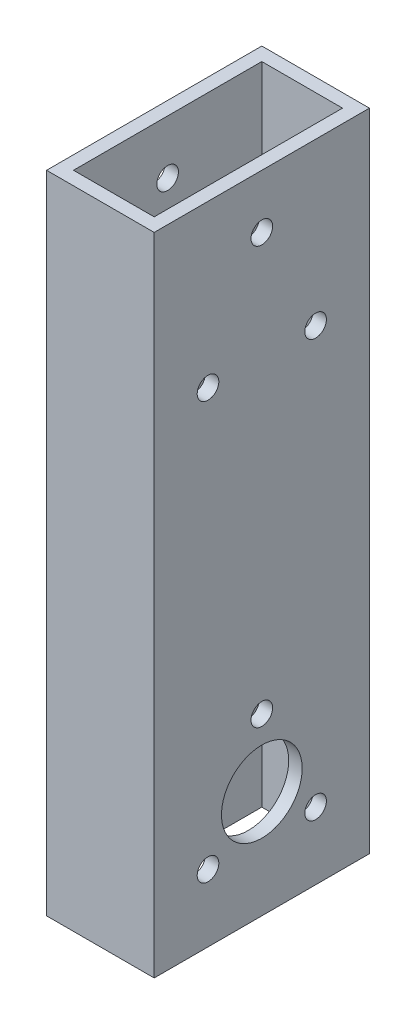
ISO-10303-21;
HEADER;
FILE_DESCRIPTION(('STEP AP214'),'2;1');
FILE_NAME('part.step','',(''),(''),'','','');
FILE_SCHEMA(('AUTOMOTIVE_DESIGN { 1 0 10303 214 1 1 1 1 }'));
ENDSEC;
DATA;
#1=APPLICATION_CONTEXT('core data for automotive mechanical design processes');
#2=APPLICATION_PROTOCOL_DEFINITION('international standard','automotive_design',2000,#1);
#3=PRODUCT_CONTEXT('',#1,'mechanical');
#4=PRODUCT('Part','Part','',(#3));
#5=PRODUCT_RELATED_PRODUCT_CATEGORY('part','',(#4));
#6=PRODUCT_DEFINITION_FORMATION('','',#4);
#7=PRODUCT_DEFINITION_CONTEXT('part definition',#1,'design');
#8=PRODUCT_DEFINITION('design','',#6,#7);
#9=PRODUCT_DEFINITION_SHAPE('','',#8);
#10=(LENGTH_UNIT() NAMED_UNIT(*) SI_UNIT(.MILLI.,.METRE.));
#11=(NAMED_UNIT(*) PLANE_ANGLE_UNIT() SI_UNIT($,.RADIAN.));
#12=(NAMED_UNIT(*) SI_UNIT($,.STERADIAN.) SOLID_ANGLE_UNIT());
#13=UNCERTAINTY_MEASURE_WITH_UNIT(LENGTH_MEASURE(1.E-05),#10,'distance_accuracy_value','');
#14=(GEOMETRIC_REPRESENTATION_CONTEXT(3) GLOBAL_UNCERTAINTY_ASSIGNED_CONTEXT((#13)) GLOBAL_UNIT_ASSIGNED_CONTEXT((#10,
#11,#12)) REPRESENTATION_CONTEXT('',''));
#15=CARTESIAN_POINT('',(0.,0.,0.));
#16=DIRECTION('',(0.,0.,1.));
#17=DIRECTION('',(1.,0.,0.));
#18=AXIS2_PLACEMENT_3D('',#15,#16,#17);
#19=CARTESIAN_POINT('',(0.,152.4,0.));
#20=DIRECTION('',(0.,-1.,0.));
#21=DIRECTION('',(0.,0.,-1.));
#22=AXIS2_PLACEMENT_3D('',#19,#20,#21);
#23=PLANE('',#22);
#24=DIRECTION('',(0.,0.,1.));
#25=VECTOR('',#24,1.);
#26=CARTESIAN_POINT('',(0.,152.4,0.));
#27=LINE('',#26,#25);
#28=CARTESIAN_POINT('',(0.,152.4,-50.8));
#29=VERTEX_POINT('',#28);
#30=CARTESIAN_POINT('',(0.,152.4,0.));
#31=VERTEX_POINT('',#30);
#32=EDGE_CURVE('E138',#29,#31,#27,.T.);
#33=ORIENTED_EDGE('',*,*,#32,.T.);
#34=DIRECTION('',(1.,0.,0.));
#35=VECTOR('',#34,1.);
#36=CARTESIAN_POINT('',(0.,152.4,0.));
#37=LINE('',#36,#35);
#38=CARTESIAN_POINT('',(25.4,152.4,0.));
#39=VERTEX_POINT('',#38);
#40=EDGE_CURVE('E141',#31,#39,#37,.T.);
#41=ORIENTED_EDGE('',*,*,#40,.T.);
#42=DIRECTION('',(0.,0.,-1.));
#43=VECTOR('',#42,1.);
#44=CARTESIAN_POINT('',(25.4,152.4,0.));
#45=LINE('',#44,#43);
#46=CARTESIAN_POINT('',(25.4,152.4,-50.8));
#47=VERTEX_POINT('',#46);
#48=EDGE_CURVE('E144',#39,#47,#45,.T.);
#49=ORIENTED_EDGE('',*,*,#48,.T.);
#50=DIRECTION('',(-1.,0.,0.));
#51=VECTOR('',#50,1.);
#52=CARTESIAN_POINT('',(0.,152.4,-50.8));
#53=LINE('',#52,#51);
#54=EDGE_CURVE('E146',#47,#29,#53,.T.);
#55=ORIENTED_EDGE('',*,*,#54,.T.);
#56=EDGE_LOOP('',(#33,#41,#49,#55));
#57=FACE_BOUND('',#56,.T.);
#58=DIRECTION('',(0.,0.,1.));
#59=VECTOR('',#58,1.);
#60=CARTESIAN_POINT('',(3.175,152.4,-3.175));
#61=LINE('',#60,#59);
#62=CARTESIAN_POINT('',(3.175,152.4,-47.625));
#63=VERTEX_POINT('',#62);
#64=CARTESIAN_POINT('',(3.175,152.4,-3.175));
#65=VERTEX_POINT('',#64);
#66=EDGE_CURVE('E100',#63,#65,#61,.T.);
#67=ORIENTED_EDGE('',*,*,#66,.F.);
#68=DIRECTION('',(-1.,0.,0.));
#69=VECTOR('',#68,1.);
#70=CARTESIAN_POINT('',(3.175,152.4,-47.625));
#71=LINE('',#70,#69);
#72=CARTESIAN_POINT('',(22.225,152.4,-47.625));
#73=VERTEX_POINT('',#72);
#74=EDGE_CURVE('E122',#73,#63,#71,.T.);
#75=ORIENTED_EDGE('',*,*,#74,.F.);
#76=DIRECTION('',(0.,0.,-1.));
#77=VECTOR('',#76,1.);
#78=CARTESIAN_POINT('',(22.225,152.4,-3.175));
#79=LINE('',#78,#77);
#80=CARTESIAN_POINT('',(22.225,152.4,-3.175));
#81=VERTEX_POINT('',#80);
#82=EDGE_CURVE('E120',#81,#73,#79,.T.);
#83=ORIENTED_EDGE('',*,*,#82,.F.);
#84=DIRECTION('',(1.,0.,0.));
#85=VECTOR('',#84,1.);
#86=CARTESIAN_POINT('',(3.175,152.4,-3.175));
#87=LINE('',#86,#85);
#88=EDGE_CURVE('E108',#65,#81,#87,.T.);
#89=ORIENTED_EDGE('',*,*,#88,.F.);
#90=EDGE_LOOP('',(#67,#75,#83,#89));
#91=FACE_BOUND('',#90,.T.);
#92=ADVANCED_FACE('F33',(#57,#91),#23,.F.);
#93=CARTESIAN_POINT('',(0.,0.,0.));
#94=DIRECTION('',(0.,-1.,0.));
#95=DIRECTION('',(0.,0.,-1.));
#96=AXIS2_PLACEMENT_3D('',#93,#94,#95);
#97=PLANE('',#96);
#98=DIRECTION('',(0.,0.,1.));
#99=VECTOR('',#98,1.);
#100=CARTESIAN_POINT('',(0.,0.,0.));
#101=LINE('',#100,#99);
#102=CARTESIAN_POINT('',(0.,0.,-50.8));
#103=VERTEX_POINT('',#102);
#104=CARTESIAN_POINT('',(0.,0.,0.));
#105=VERTEX_POINT('',#104);
#106=EDGE_CURVE('E116',#103,#105,#101,.T.);
#107=ORIENTED_EDGE('',*,*,#106,.F.);
#108=DIRECTION('',(-1.,0.,0.));
#109=VECTOR('',#108,1.);
#110=CARTESIAN_POINT('',(0.,0.,-50.8));
#111=LINE('',#110,#109);
#112=CARTESIAN_POINT('',(25.4,0.,-50.8));
#113=VERTEX_POINT('',#112);
#114=EDGE_CURVE('E142',#113,#103,#111,.T.);
#115=ORIENTED_EDGE('',*,*,#114,.F.);
#116=DIRECTION('',(0.,0.,-1.));
#117=VECTOR('',#116,1.);
#118=CARTESIAN_POINT('',(25.4,0.,0.));
#119=LINE('',#118,#117);
#120=CARTESIAN_POINT('',(25.4,0.,0.));
#121=VERTEX_POINT('',#120);
#122=EDGE_CURVE('E153',#121,#113,#119,.T.);
#123=ORIENTED_EDGE('',*,*,#122,.F.);
#124=DIRECTION('',(1.,0.,0.));
#125=VECTOR('',#124,1.);
#126=CARTESIAN_POINT('',(0.,0.,0.));
#127=LINE('',#126,#125);
#128=EDGE_CURVE('E151',#105,#121,#127,.T.);
#129=ORIENTED_EDGE('',*,*,#128,.F.);
#130=EDGE_LOOP('',(#107,#115,#123,#129));
#131=FACE_BOUND('',#130,.T.);
#132=DIRECTION('',(-1.,0.,0.));
#133=VECTOR('',#132,1.);
#134=CARTESIAN_POINT('',(3.175,0.,-47.625));
#135=LINE('',#134,#133);
#136=CARTESIAN_POINT('',(22.225,0.,-47.625));
#137=VERTEX_POINT('',#136);
#138=CARTESIAN_POINT('',(3.175,0.,-47.625));
#139=VERTEX_POINT('',#138);
#140=EDGE_CURVE('E109',#137,#139,#135,.T.);
#141=ORIENTED_EDGE('',*,*,#140,.T.);
#142=DIRECTION('',(0.,0.,1.));
#143=VECTOR('',#142,1.);
#144=CARTESIAN_POINT('',(3.175,0.,-3.175));
#145=LINE('',#144,#143);
#146=CARTESIAN_POINT('',(3.175,0.,-3.175));
#147=VERTEX_POINT('',#146);
#148=EDGE_CURVE('E58',#139,#147,#145,.T.);
#149=ORIENTED_EDGE('',*,*,#148,.T.);
#150=DIRECTION('',(1.,0.,0.));
#151=VECTOR('',#150,1.);
#152=CARTESIAN_POINT('',(3.175,0.,-3.175));
#153=LINE('',#152,#151);
#154=CARTESIAN_POINT('',(22.225,0.,-3.175));
#155=VERTEX_POINT('',#154);
#156=EDGE_CURVE('E115',#147,#155,#153,.T.);
#157=ORIENTED_EDGE('',*,*,#156,.T.);
#158=DIRECTION('',(0.,0.,-1.));
#159=VECTOR('',#158,1.);
#160=CARTESIAN_POINT('',(22.225,0.,-3.175));
#161=LINE('',#160,#159);
#162=EDGE_CURVE('E130',#155,#137,#161,.T.);
#163=ORIENTED_EDGE('',*,*,#162,.T.);
#164=EDGE_LOOP('',(#141,#149,#157,#163));
#165=FACE_BOUND('',#164,.T.);
#166=ADVANCED_FACE('F260',(#131,#165),#97,.T.);
#167=CARTESIAN_POINT('',(0.,152.4,0.));
#168=DIRECTION('',(1.,0.,0.));
#169=DIRECTION('',(0.,0.,-1.));
#170=AXIS2_PLACEMENT_3D('',#167,#168,#169);
#171=PLANE('',#170);
#172=CARTESIAN_POINT('',(0.,25.4,-25.4));
#173=DIRECTION('',(1.,0.,0.));
#174=DIRECTION('',(0.,0.,-1.));
#175=AXIS2_PLACEMENT_3D('',#172,#173,#174);
#176=CIRCLE('',#175,9.525);
#177=CARTESIAN_POINT('',(0.,25.4,-34.925));
#178=VERTEX_POINT('',#177);
#179=EDGE_CURVE('E371',#178,#178,#176,.T.);
#180=ORIENTED_EDGE('',*,*,#179,.T.);
#181=EDGE_LOOP('',(#180));
#182=FACE_BOUND('',#181,.T.);
#183=CARTESIAN_POINT('',(0.,15.8749999999994,-38.1));
#184=DIRECTION('',(1.,0.,0.));
#185=DIRECTION('',(0.,0.,-1.));
#186=AXIS2_PLACEMENT_3D('',#183,#184,#185);
#187=CIRCLE('',#186,2.55269999999998);
#188=CARTESIAN_POINT('',(0.,15.8749999999994,-40.6527));
#189=VERTEX_POINT('',#188);
#190=EDGE_CURVE('E194',#189,#189,#187,.T.);
#191=ORIENTED_EDGE('',*,*,#190,.T.);
#192=EDGE_LOOP('',(#191));
#193=FACE_BOUND('',#192,.T.);
#194=CARTESIAN_POINT('',(0.,15.8749999999994,-12.7));
#195=DIRECTION('',(1.,0.,0.));
#196=DIRECTION('',(0.,0.,-1.));
#197=AXIS2_PLACEMENT_3D('',#194,#195,#196);
#198=CIRCLE('',#197,2.55270000000011);
#199=CARTESIAN_POINT('',(0.,15.8749999999994,-15.2527000000001));
#200=VERTEX_POINT('',#199);
#201=EDGE_CURVE('E211',#200,#200,#198,.T.);
#202=ORIENTED_EDGE('',*,*,#201,.T.);
#203=EDGE_LOOP('',(#202));
#204=FACE_BOUND('',#203,.T.);
#205=CARTESIAN_POINT('',(0.,41.275,-25.4));
#206=DIRECTION('',(1.,0.,0.));
#207=DIRECTION('',(0.,0.,-1.));
#208=AXIS2_PLACEMENT_3D('',#205,#206,#207);
#209=CIRCLE('',#208,2.55269999999999);
#210=CARTESIAN_POINT('',(0.,41.275,-27.9527));
#211=VERTEX_POINT('',#210);
#212=EDGE_CURVE('E218',#211,#211,#209,.T.);
#213=ORIENTED_EDGE('',*,*,#212,.T.);
#214=EDGE_LOOP('',(#213));
#215=FACE_BOUND('',#214,.T.);
#216=CARTESIAN_POINT('',(0.,114.3,-38.1));
#217=DIRECTION('',(1.,0.,0.));
#218=DIRECTION('',(0.,0.,-1.));
#219=AXIS2_PLACEMENT_3D('',#216,#217,#218);
#220=CIRCLE('',#219,2.5527);
#221=CARTESIAN_POINT('',(0.,114.3,-40.6527));
#222=VERTEX_POINT('',#221);
#223=EDGE_CURVE('E225',#222,#222,#220,.T.);
#224=ORIENTED_EDGE('',*,*,#223,.T.);
#225=EDGE_LOOP('',(#224));
#226=FACE_BOUND('',#225,.T.);
#227=CARTESIAN_POINT('',(0.,114.3,-12.7));
#228=DIRECTION('',(1.,0.,0.));
#229=DIRECTION('',(0.,0.,-1.));
#230=AXIS2_PLACEMENT_3D('',#227,#228,#229);
#231=CIRCLE('',#230,2.5527);
#232=CARTESIAN_POINT('',(0.,114.3,-15.2527));
#233=VERTEX_POINT('',#232);
#234=EDGE_CURVE('E232',#233,#233,#231,.T.);
#235=ORIENTED_EDGE('',*,*,#234,.T.);
#236=EDGE_LOOP('',(#235));
#237=FACE_BOUND('',#236,.T.);
#238=CARTESIAN_POINT('',(0.,139.7,-25.4));
#239=DIRECTION('',(1.,0.,0.));
#240=DIRECTION('',(0.,0.,-1.));
#241=AXIS2_PLACEMENT_3D('',#238,#239,#240);
#242=CIRCLE('',#241,2.5527);
#243=CARTESIAN_POINT('',(0.,139.7,-27.9527));
#244=VERTEX_POINT('',#243);
#245=EDGE_CURVE('E128',#244,#244,#242,.T.);
#246=ORIENTED_EDGE('',*,*,#245,.T.);
#247=EDGE_LOOP('',(#246));
#248=FACE_BOUND('',#247,.T.);
#249=ORIENTED_EDGE('',*,*,#106,.T.);
#250=DIRECTION('',(0.,-1.,0.));
#251=VECTOR('',#250,1.);
#252=CARTESIAN_POINT('',(0.,152.4,0.));
#253=LINE('',#252,#251);
#254=EDGE_CURVE('E11',#31,#105,#253,.T.);
#255=ORIENTED_EDGE('',*,*,#254,.F.);
#256=ORIENTED_EDGE('',*,*,#32,.F.);
#257=DIRECTION('',(0.,-1.,0.));
#258=VECTOR('',#257,1.);
#259=CARTESIAN_POINT('',(0.,152.4,-50.8));
#260=LINE('',#259,#258);
#261=EDGE_CURVE('E148',#29,#103,#260,.T.);
#262=ORIENTED_EDGE('',*,*,#261,.T.);
#263=EDGE_LOOP('',(#249,#255,#256,#262));
#264=FACE_BOUND('',#263,.T.);
#265=ADVANCED_FACE('F35',(#182,#193,#204,#215,#226,#237,#248,#264),#171,.F.);
#266=CARTESIAN_POINT('',(0.,152.4,0.));
#267=DIRECTION('',(0.,0.,-1.));
#268=DIRECTION('',(-1.,0.,0.));
#269=AXIS2_PLACEMENT_3D('',#266,#267,#268);
#270=PLANE('',#269);
#271=ORIENTED_EDGE('',*,*,#128,.T.);
#272=DIRECTION('',(0.,-1.,0.));
#273=VECTOR('',#272,1.);
#274=CARTESIAN_POINT('',(25.4,152.4,0.));
#275=LINE('',#274,#273);
#276=EDGE_CURVE('E42',#39,#121,#275,.T.);
#277=ORIENTED_EDGE('',*,*,#276,.F.);
#278=ORIENTED_EDGE('',*,*,#40,.F.);
#279=ORIENTED_EDGE('',*,*,#254,.T.);
#280=EDGE_LOOP('',(#271,#277,#278,#279));
#281=FACE_BOUND('',#280,.T.);
#282=ADVANCED_FACE('F277',(#281),#270,.F.);
#283=CARTESIAN_POINT('',(25.4,152.4,0.));
#284=DIRECTION('',(-1.,0.,0.));
#285=DIRECTION('',(0.,0.,1.));
#286=AXIS2_PLACEMENT_3D('',#283,#284,#285);
#287=PLANE('',#286);
#288=CARTESIAN_POINT('',(25.4,25.4,-25.4));
#289=DIRECTION('',(1.,0.,0.));
#290=DIRECTION('',(0.,0.,-1.));
#291=AXIS2_PLACEMENT_3D('',#288,#289,#290);
#292=CIRCLE('',#291,9.525);
#293=CARTESIAN_POINT('',(25.4,25.4,-34.925));
#294=VERTEX_POINT('',#293);
#295=EDGE_CURVE('E370',#294,#294,#292,.T.);
#296=ORIENTED_EDGE('',*,*,#295,.F.);
#297=EDGE_LOOP('',(#296));
#298=FACE_BOUND('',#297,.T.);
#299=CARTESIAN_POINT('',(25.4,15.8749999999994,-38.1));
#300=DIRECTION('',(1.,0.,0.));
#301=DIRECTION('',(0.,0.,-1.));
#302=AXIS2_PLACEMENT_3D('',#299,#300,#301);
#303=CIRCLE('',#302,2.55269999999998);
#304=CARTESIAN_POINT('',(25.4,15.8749999999994,-40.6527));
#305=VERTEX_POINT('',#304);
#306=EDGE_CURVE('E190',#305,#305,#303,.T.);
#307=ORIENTED_EDGE('',*,*,#306,.F.);
#308=EDGE_LOOP('',(#307));
#309=FACE_BOUND('',#308,.T.);
#310=CARTESIAN_POINT('',(25.4,15.8749999999994,-12.7));
#311=DIRECTION('',(1.,0.,0.));
#312=DIRECTION('',(0.,0.,-1.));
#313=AXIS2_PLACEMENT_3D('',#310,#311,#312);
#314=CIRCLE('',#313,2.55270000000011);
#315=CARTESIAN_POINT('',(25.4,15.8749999999994,-15.2527000000001));
#316=VERTEX_POINT('',#315);
#317=EDGE_CURVE('E186',#316,#316,#314,.T.);
#318=ORIENTED_EDGE('',*,*,#317,.F.);
#319=EDGE_LOOP('',(#318));
#320=FACE_BOUND('',#319,.T.);
#321=CARTESIAN_POINT('',(25.4,41.275,-25.4));
#322=DIRECTION('',(1.,0.,0.));
#323=DIRECTION('',(0.,0.,-1.));
#324=AXIS2_PLACEMENT_3D('',#321,#322,#323);
#325=CIRCLE('',#324,2.55269999999999);
#326=CARTESIAN_POINT('',(25.4,41.275,-27.9527));
#327=VERTEX_POINT('',#326);
#328=EDGE_CURVE('E182',#327,#327,#325,.T.);
#329=ORIENTED_EDGE('',*,*,#328,.F.);
#330=EDGE_LOOP('',(#329));
#331=FACE_BOUND('',#330,.T.);
#332=CARTESIAN_POINT('',(25.4,114.3,-38.1));
#333=DIRECTION('',(1.,0.,0.));
#334=DIRECTION('',(0.,0.,-1.));
#335=AXIS2_PLACEMENT_3D('',#332,#333,#334);
#336=CIRCLE('',#335,2.5527);
#337=CARTESIAN_POINT('',(25.4,114.3,-40.6527));
#338=VERTEX_POINT('',#337);
#339=EDGE_CURVE('E177',#338,#338,#336,.T.);
#340=ORIENTED_EDGE('',*,*,#339,.F.);
#341=EDGE_LOOP('',(#340));
#342=FACE_BOUND('',#341,.T.);
#343=CARTESIAN_POINT('',(25.4,114.3,-12.7));
#344=DIRECTION('',(1.,0.,0.));
#345=DIRECTION('',(0.,0.,-1.));
#346=AXIS2_PLACEMENT_3D('',#343,#344,#345);
#347=CIRCLE('',#346,2.5527);
#348=CARTESIAN_POINT('',(25.4,114.3,-15.2527));
#349=VERTEX_POINT('',#348);
#350=EDGE_CURVE('E172',#349,#349,#347,.T.);
#351=ORIENTED_EDGE('',*,*,#350,.F.);
#352=EDGE_LOOP('',(#351));
#353=FACE_BOUND('',#352,.T.);
#354=CARTESIAN_POINT('',(25.4,139.7,-25.4));
#355=DIRECTION('',(1.,0.,0.));
#356=DIRECTION('',(0.,0.,-1.));
#357=AXIS2_PLACEMENT_3D('',#354,#355,#356);
#358=CIRCLE('',#357,2.5527);
#359=CARTESIAN_POINT('',(25.4,139.7,-27.9527));
#360=VERTEX_POINT('',#359);
#361=EDGE_CURVE('E167',#360,#360,#358,.T.);
#362=ORIENTED_EDGE('',*,*,#361,.F.);
#363=EDGE_LOOP('',(#362));
#364=FACE_BOUND('',#363,.T.);
#365=ORIENTED_EDGE('',*,*,#122,.T.);
#366=DIRECTION('',(0.,-1.,0.));
#367=VECTOR('',#366,1.);
#368=CARTESIAN_POINT('',(25.4,152.4,-50.8));
#369=LINE('',#368,#367);
#370=EDGE_CURVE('E158',#47,#113,#369,.T.);
#371=ORIENTED_EDGE('',*,*,#370,.F.);
#372=ORIENTED_EDGE('',*,*,#48,.F.);
#373=ORIENTED_EDGE('',*,*,#276,.T.);
#374=EDGE_LOOP('',(#365,#371,#372,#373));
#375=FACE_BOUND('',#374,.T.);
#376=ADVANCED_FACE('F274',(#298,#309,#320,#331,#342,#353,#364,#375),#287,.F.);
#377=CARTESIAN_POINT('',(0.,152.4,-50.8));
#378=DIRECTION('',(0.,0.,1.));
#379=DIRECTION('',(1.,0.,0.));
#380=AXIS2_PLACEMENT_3D('',#377,#378,#379);
#381=PLANE('',#380);
#382=ORIENTED_EDGE('',*,*,#114,.T.);
#383=ORIENTED_EDGE('',*,*,#261,.F.);
#384=ORIENTED_EDGE('',*,*,#54,.F.);
#385=ORIENTED_EDGE('',*,*,#370,.T.);
#386=EDGE_LOOP('',(#382,#383,#384,#385));
#387=FACE_BOUND('',#386,.T.);
#388=ADVANCED_FACE('F271',(#387),#381,.F.);
#389=CARTESIAN_POINT('',(3.175,152.4,-3.175));
#390=DIRECTION('',(1.,0.,0.));
#391=DIRECTION('',(0.,0.,-1.));
#392=AXIS2_PLACEMENT_3D('',#389,#390,#391);
#393=PLANE('',#392);
#394=CARTESIAN_POINT('',(3.175,25.4,-25.4));
#395=DIRECTION('',(1.,0.,0.));
#396=DIRECTION('',(0.,0.,-1.));
#397=AXIS2_PLACEMENT_3D('',#394,#395,#396);
#398=CIRCLE('',#397,9.525);
#399=CARTESIAN_POINT('',(3.175,25.4,-34.925));
#400=VERTEX_POINT('',#399);
#401=EDGE_CURVE('E197',#400,#400,#398,.T.);
#402=ORIENTED_EDGE('',*,*,#401,.F.);
#403=EDGE_LOOP('',(#402));
#404=FACE_BOUND('',#403,.T.);
#405=CARTESIAN_POINT('',(3.175,15.8749999999994,-38.1));
#406=DIRECTION('',(1.,0.,0.));
#407=DIRECTION('',(0.,0.,-1.));
#408=AXIS2_PLACEMENT_3D('',#405,#406,#407);
#409=CIRCLE('',#408,2.55269999999998);
#410=CARTESIAN_POINT('',(3.175,15.8749999999994,-40.6527));
#411=VERTEX_POINT('',#410);
#412=EDGE_CURVE('E189',#411,#411,#409,.T.);
#413=ORIENTED_EDGE('',*,*,#412,.F.);
#414=EDGE_LOOP('',(#413));
#415=FACE_BOUND('',#414,.T.);
#416=CARTESIAN_POINT('',(3.175,15.8749999999994,-12.7));
#417=DIRECTION('',(1.,0.,0.));
#418=DIRECTION('',(0.,0.,-1.));
#419=AXIS2_PLACEMENT_3D('',#416,#417,#418);
#420=CIRCLE('',#419,2.55270000000011);
#421=CARTESIAN_POINT('',(3.175,15.8749999999994,-15.2527000000001));
#422=VERTEX_POINT('',#421);
#423=EDGE_CURVE('E185',#422,#422,#420,.T.);
#424=ORIENTED_EDGE('',*,*,#423,.F.);
#425=EDGE_LOOP('',(#424));
#426=FACE_BOUND('',#425,.T.);
#427=CARTESIAN_POINT('',(3.175,41.275,-25.4));
#428=DIRECTION('',(1.,0.,0.));
#429=DIRECTION('',(0.,0.,-1.));
#430=AXIS2_PLACEMENT_3D('',#427,#428,#429);
#431=CIRCLE('',#430,2.55269999999999);
#432=CARTESIAN_POINT('',(3.175,41.275,-27.9527));
#433=VERTEX_POINT('',#432);
#434=EDGE_CURVE('E181',#433,#433,#431,.T.);
#435=ORIENTED_EDGE('',*,*,#434,.F.);
#436=EDGE_LOOP('',(#435));
#437=FACE_BOUND('',#436,.T.);
#438=CARTESIAN_POINT('',(3.175,114.3,-38.1));
#439=DIRECTION('',(1.,0.,0.));
#440=DIRECTION('',(0.,0.,-1.));
#441=AXIS2_PLACEMENT_3D('',#438,#439,#440);
#442=CIRCLE('',#441,2.5527);
#443=CARTESIAN_POINT('',(3.175,114.3,-40.6527));
#444=VERTEX_POINT('',#443);
#445=EDGE_CURVE('E176',#444,#444,#442,.T.);
#446=ORIENTED_EDGE('',*,*,#445,.F.);
#447=EDGE_LOOP('',(#446));
#448=FACE_BOUND('',#447,.T.);
#449=CARTESIAN_POINT('',(3.175,114.3,-12.7));
#450=DIRECTION('',(1.,0.,0.));
#451=DIRECTION('',(0.,0.,-1.));
#452=AXIS2_PLACEMENT_3D('',#449,#450,#451);
#453=CIRCLE('',#452,2.5527);
#454=CARTESIAN_POINT('',(3.175,114.3,-15.2527));
#455=VERTEX_POINT('',#454);
#456=EDGE_CURVE('E171',#455,#455,#453,.T.);
#457=ORIENTED_EDGE('',*,*,#456,.F.);
#458=EDGE_LOOP('',(#457));
#459=FACE_BOUND('',#458,.T.);
#460=CARTESIAN_POINT('',(3.175,139.7,-25.4));
#461=DIRECTION('',(1.,0.,0.));
#462=DIRECTION('',(0.,0.,-1.));
#463=AXIS2_PLACEMENT_3D('',#460,#461,#462);
#464=CIRCLE('',#463,2.5527);
#465=CARTESIAN_POINT('',(3.175,139.7,-27.9527));
#466=VERTEX_POINT('',#465);
#467=EDGE_CURVE('E166',#466,#466,#464,.T.);
#468=ORIENTED_EDGE('',*,*,#467,.F.);
#469=EDGE_LOOP('',(#468));
#470=FACE_BOUND('',#469,.T.);
#471=ORIENTED_EDGE('',*,*,#148,.F.);
#472=DIRECTION('',(0.,-1.,0.));
#473=VECTOR('',#472,1.);
#474=CARTESIAN_POINT('',(3.175,152.4,-47.625));
#475=LINE('',#474,#473);
#476=EDGE_CURVE('E104',#63,#139,#475,.T.);
#477=ORIENTED_EDGE('',*,*,#476,.F.);
#478=ORIENTED_EDGE('',*,*,#66,.T.);
#479=DIRECTION('',(0.,-1.,0.));
#480=VECTOR('',#479,1.);
#481=CARTESIAN_POINT('',(3.175,152.4,-3.175));
#482=LINE('',#481,#480);
#483=EDGE_CURVE('E103',#65,#147,#482,.T.);
#484=ORIENTED_EDGE('',*,*,#483,.T.);
#485=EDGE_LOOP('',(#471,#477,#478,#484));
#486=FACE_BOUND('',#485,.T.);
#487=ADVANCED_FACE('F102',(#404,#415,#426,#437,#448,#459,#470,#486),#393,.T.);
#488=CARTESIAN_POINT('',(3.175,152.4,-3.175));
#489=DIRECTION('',(0.,0.,-1.));
#490=DIRECTION('',(-1.,0.,0.));
#491=AXIS2_PLACEMENT_3D('',#488,#489,#490);
#492=PLANE('',#491);
#493=ORIENTED_EDGE('',*,*,#156,.F.);
#494=ORIENTED_EDGE('',*,*,#483,.F.);
#495=ORIENTED_EDGE('',*,*,#88,.T.);
#496=DIRECTION('',(0.,-1.,0.));
#497=VECTOR('',#496,1.);
#498=CARTESIAN_POINT('',(22.225,152.4,-3.175));
#499=LINE('',#498,#497);
#500=EDGE_CURVE('E117',#81,#155,#499,.T.);
#501=ORIENTED_EDGE('',*,*,#500,.T.);
#502=EDGE_LOOP('',(#493,#494,#495,#501));
#503=FACE_BOUND('',#502,.T.);
#504=ADVANCED_FACE('F112',(#503),#492,.T.);
#505=CARTESIAN_POINT('',(22.225,152.4,-3.175));
#506=DIRECTION('',(-1.,0.,0.));
#507=DIRECTION('',(0.,0.,1.));
#508=AXIS2_PLACEMENT_3D('',#505,#506,#507);
#509=PLANE('',#508);
#510=CARTESIAN_POINT('',(22.225,25.4,-25.4));
#511=DIRECTION('',(-1.,0.,0.));
#512=DIRECTION('',(0.,0.,1.));
#513=AXIS2_PLACEMENT_3D('',#510,#511,#512);
#514=CIRCLE('',#513,9.525);
#515=CARTESIAN_POINT('',(22.225,25.4,-15.875));
#516=VERTEX_POINT('',#515);
#517=EDGE_CURVE('E37',#516,#516,#514,.T.);
#518=ORIENTED_EDGE('',*,*,#517,.F.);
#519=EDGE_LOOP('',(#518));
#520=FACE_BOUND('',#519,.T.);
#521=CARTESIAN_POINT('',(22.225,15.8749999999994,-38.1));
#522=DIRECTION('',(-1.,0.,0.));
#523=DIRECTION('',(0.,0.,1.));
#524=AXIS2_PLACEMENT_3D('',#521,#522,#523);
#525=CIRCLE('',#524,2.55269999999998);
#526=CARTESIAN_POINT('',(22.225,15.8749999999994,-35.5473));
#527=VERTEX_POINT('',#526);
#528=EDGE_CURVE('E187',#527,#527,#525,.T.);
#529=ORIENTED_EDGE('',*,*,#528,.F.);
#530=EDGE_LOOP('',(#529));
#531=FACE_BOUND('',#530,.T.);
#532=CARTESIAN_POINT('',(22.225,15.8749999999994,-12.7));
#533=DIRECTION('',(-1.,0.,0.));
#534=DIRECTION('',(0.,0.,1.));
#535=AXIS2_PLACEMENT_3D('',#532,#533,#534);
#536=CIRCLE('',#535,2.55270000000011);
#537=CARTESIAN_POINT('',(22.225,15.8749999999994,-10.1472999999999));
#538=VERTEX_POINT('',#537);
#539=EDGE_CURVE('E183',#538,#538,#536,.T.);
#540=ORIENTED_EDGE('',*,*,#539,.F.);
#541=EDGE_LOOP('',(#540));
#542=FACE_BOUND('',#541,.T.);
#543=CARTESIAN_POINT('',(22.225,41.275,-25.4));
#544=DIRECTION('',(-1.,0.,0.));
#545=DIRECTION('',(0.,0.,1.));
#546=AXIS2_PLACEMENT_3D('',#543,#544,#545);
#547=CIRCLE('',#546,2.55269999999999);
#548=CARTESIAN_POINT('',(22.225,41.275,-22.8473));
#549=VERTEX_POINT('',#548);
#550=EDGE_CURVE('E178',#549,#549,#547,.T.);
#551=ORIENTED_EDGE('',*,*,#550,.F.);
#552=EDGE_LOOP('',(#551));
#553=FACE_BOUND('',#552,.T.);
#554=CARTESIAN_POINT('',(22.225,114.3,-38.1));
#555=DIRECTION('',(-1.,0.,0.));
#556=DIRECTION('',(0.,0.,1.));
#557=AXIS2_PLACEMENT_3D('',#554,#555,#556);
#558=CIRCLE('',#557,2.5527);
#559=CARTESIAN_POINT('',(22.225,114.3,-35.5473));
#560=VERTEX_POINT('',#559);
#561=EDGE_CURVE('E173',#560,#560,#558,.T.);
#562=ORIENTED_EDGE('',*,*,#561,.F.);
#563=EDGE_LOOP('',(#562));
#564=FACE_BOUND('',#563,.T.);
#565=CARTESIAN_POINT('',(22.225,114.3,-12.7));
#566=DIRECTION('',(-1.,0.,0.));
#567=DIRECTION('',(0.,0.,1.));
#568=AXIS2_PLACEMENT_3D('',#565,#566,#567);
#569=CIRCLE('',#568,2.5527);
#570=CARTESIAN_POINT('',(22.225,114.3,-10.1473));
#571=VERTEX_POINT('',#570);
#572=EDGE_CURVE('E168',#571,#571,#569,.T.);
#573=ORIENTED_EDGE('',*,*,#572,.F.);
#574=EDGE_LOOP('',(#573));
#575=FACE_BOUND('',#574,.T.);
#576=CARTESIAN_POINT('',(22.225,139.7,-25.4));
#577=DIRECTION('',(-1.,0.,0.));
#578=DIRECTION('',(0.,0.,1.));
#579=AXIS2_PLACEMENT_3D('',#576,#577,#578);
#580=CIRCLE('',#579,2.5527);
#581=CARTESIAN_POINT('',(22.225,139.7,-22.8473));
#582=VERTEX_POINT('',#581);
#583=EDGE_CURVE('E163',#582,#582,#580,.T.);
#584=ORIENTED_EDGE('',*,*,#583,.F.);
#585=EDGE_LOOP('',(#584));
#586=FACE_BOUND('',#585,.T.);
#587=ORIENTED_EDGE('',*,*,#162,.F.);
#588=ORIENTED_EDGE('',*,*,#500,.F.);
#589=ORIENTED_EDGE('',*,*,#82,.T.);
#590=DIRECTION('',(0.,-1.,0.));
#591=VECTOR('',#590,1.);
#592=CARTESIAN_POINT('',(22.225,152.4,-47.625));
#593=LINE('',#592,#591);
#594=EDGE_CURVE('E50',#73,#137,#593,.T.);
#595=ORIENTED_EDGE('',*,*,#594,.T.);
#596=EDGE_LOOP('',(#587,#588,#589,#595));
#597=FACE_BOUND('',#596,.T.);
#598=ADVANCED_FACE('F301',(#520,#531,#542,#553,#564,#575,#586,#597),#509,.T.);
#599=CARTESIAN_POINT('',(3.175,152.4,-47.625));
#600=DIRECTION('',(0.,0.,1.));
#601=DIRECTION('',(1.,0.,0.));
#602=AXIS2_PLACEMENT_3D('',#599,#600,#601);
#603=PLANE('',#602);
#604=ORIENTED_EDGE('',*,*,#140,.F.);
#605=ORIENTED_EDGE('',*,*,#594,.F.);
#606=ORIENTED_EDGE('',*,*,#74,.T.);
#607=ORIENTED_EDGE('',*,*,#476,.T.);
#608=EDGE_LOOP('',(#604,#605,#606,#607));
#609=FACE_BOUND('',#608,.T.);
#610=ADVANCED_FACE('F256',(#609),#603,.T.);
#611=CARTESIAN_POINT('',(-25.4,139.7,-25.4));
#612=DIRECTION('',(1.,0.,0.));
#613=DIRECTION('',(0.,0.,-1.));
#614=AXIS2_PLACEMENT_3D('',#611,#612,#613);
#615=CYLINDRICAL_SURFACE('',#614,2.5527);
#616=ORIENTED_EDGE('',*,*,#583,.T.);
#617=EDGE_LOOP('',(#616));
#618=FACE_BOUND('',#617,.T.);
#619=ORIENTED_EDGE('',*,*,#361,.T.);
#620=EDGE_LOOP('',(#619));
#621=FACE_BOUND('',#620,.T.);
#622=ADVANCED_FACE('F246',(#618,#621),#615,.F.);
#623=ORIENTED_EDGE('',*,*,#467,.T.);
#624=EDGE_LOOP('',(#623));
#625=FACE_BOUND('',#624,.T.);
#626=ORIENTED_EDGE('',*,*,#245,.F.);
#627=EDGE_LOOP('',(#626));
#628=FACE_BOUND('',#627,.T.);
#629=ADVANCED_FACE('F243',(#625,#628),#615,.F.);
#630=CARTESIAN_POINT('',(-25.4,114.3,-12.7));
#631=DIRECTION('',(1.,0.,0.));
#632=DIRECTION('',(0.,0.,-1.));
#633=AXIS2_PLACEMENT_3D('',#630,#631,#632);
#634=CYLINDRICAL_SURFACE('',#633,2.5527);
#635=ORIENTED_EDGE('',*,*,#572,.T.);
#636=EDGE_LOOP('',(#635));
#637=FACE_BOUND('',#636,.T.);
#638=ORIENTED_EDGE('',*,*,#350,.T.);
#639=EDGE_LOOP('',(#638));
#640=FACE_BOUND('',#639,.T.);
#641=ADVANCED_FACE('F245',(#637,#640),#634,.F.);
#642=ORIENTED_EDGE('',*,*,#456,.T.);
#643=EDGE_LOOP('',(#642));
#644=FACE_BOUND('',#643,.T.);
#645=ORIENTED_EDGE('',*,*,#234,.F.);
#646=EDGE_LOOP('',(#645));
#647=FACE_BOUND('',#646,.T.);
#648=ADVANCED_FACE('F253',(#644,#647),#634,.F.);
#649=CARTESIAN_POINT('',(-25.4,114.3,-38.1));
#650=DIRECTION('',(1.,0.,0.));
#651=DIRECTION('',(0.,0.,-1.));
#652=AXIS2_PLACEMENT_3D('',#649,#650,#651);
#653=CYLINDRICAL_SURFACE('',#652,2.5527);
#654=ORIENTED_EDGE('',*,*,#561,.T.);
#655=EDGE_LOOP('',(#654));
#656=FACE_BOUND('',#655,.T.);
#657=ORIENTED_EDGE('',*,*,#339,.T.);
#658=EDGE_LOOP('',(#657));
#659=FACE_BOUND('',#658,.T.);
#660=ADVANCED_FACE('F331',(#656,#659),#653,.F.);
#661=ORIENTED_EDGE('',*,*,#445,.T.);
#662=EDGE_LOOP('',(#661));
#663=FACE_BOUND('',#662,.T.);
#664=ORIENTED_EDGE('',*,*,#223,.F.);
#665=EDGE_LOOP('',(#664));
#666=FACE_BOUND('',#665,.T.);
#667=ADVANCED_FACE('F337',(#663,#666),#653,.F.);
#668=CARTESIAN_POINT('',(-25.4,41.275,-25.4));
#669=DIRECTION('',(1.,0.,0.));
#670=DIRECTION('',(0.,0.,-1.));
#671=AXIS2_PLACEMENT_3D('',#668,#669,#670);
#672=CYLINDRICAL_SURFACE('',#671,2.55269999999999);
#673=ORIENTED_EDGE('',*,*,#550,.T.);
#674=EDGE_LOOP('',(#673));
#675=FACE_BOUND('',#674,.T.);
#676=ORIENTED_EDGE('',*,*,#328,.T.);
#677=EDGE_LOOP('',(#676));
#678=FACE_BOUND('',#677,.T.);
#679=ADVANCED_FACE('F341',(#675,#678),#672,.F.);
#680=ORIENTED_EDGE('',*,*,#434,.T.);
#681=EDGE_LOOP('',(#680));
#682=FACE_BOUND('',#681,.T.);
#683=ORIENTED_EDGE('',*,*,#212,.F.);
#684=EDGE_LOOP('',(#683));
#685=FACE_BOUND('',#684,.T.);
#686=ADVANCED_FACE('F344',(#682,#685),#672,.F.);
#687=CARTESIAN_POINT('',(-25.4,15.8749999999994,-12.7));
#688=DIRECTION('',(1.,0.,0.));
#689=DIRECTION('',(0.,0.,-1.));
#690=AXIS2_PLACEMENT_3D('',#687,#688,#689);
#691=CYLINDRICAL_SURFACE('',#690,2.55270000000011);
#692=ORIENTED_EDGE('',*,*,#539,.T.);
#693=EDGE_LOOP('',(#692));
#694=FACE_BOUND('',#693,.T.);
#695=ORIENTED_EDGE('',*,*,#317,.T.);
#696=EDGE_LOOP('',(#695));
#697=FACE_BOUND('',#696,.T.);
#698=ADVANCED_FACE('F346',(#694,#697),#691,.F.);
#699=ORIENTED_EDGE('',*,*,#423,.T.);
#700=EDGE_LOOP('',(#699));
#701=FACE_BOUND('',#700,.T.);
#702=ORIENTED_EDGE('',*,*,#201,.F.);
#703=EDGE_LOOP('',(#702));
#704=FACE_BOUND('',#703,.T.);
#705=ADVANCED_FACE('F349',(#701,#704),#691,.F.);
#706=CARTESIAN_POINT('',(-25.4,15.8749999999994,-38.1));
#707=DIRECTION('',(1.,0.,0.));
#708=DIRECTION('',(0.,0.,-1.));
#709=AXIS2_PLACEMENT_3D('',#706,#707,#708);
#710=CYLINDRICAL_SURFACE('',#709,2.55269999999998);
#711=ORIENTED_EDGE('',*,*,#528,.T.);
#712=EDGE_LOOP('',(#711));
#713=FACE_BOUND('',#712,.T.);
#714=ORIENTED_EDGE('',*,*,#306,.T.);
#715=EDGE_LOOP('',(#714));
#716=FACE_BOUND('',#715,.T.);
#717=ADVANCED_FACE('F351',(#713,#716),#710,.F.);
#718=ORIENTED_EDGE('',*,*,#412,.T.);
#719=EDGE_LOOP('',(#718));
#720=FACE_BOUND('',#719,.T.);
#721=ORIENTED_EDGE('',*,*,#190,.F.);
#722=EDGE_LOOP('',(#721));
#723=FACE_BOUND('',#722,.T.);
#724=ADVANCED_FACE('F354',(#720,#723),#710,.F.);
#725=CARTESIAN_POINT('',(0.,25.4,-25.4));
#726=DIRECTION('',(1.,0.,0.));
#727=DIRECTION('',(0.,0.,-1.));
#728=AXIS2_PLACEMENT_3D('',#725,#726,#727);
#729=CYLINDRICAL_SURFACE('',#728,9.525);
#730=ORIENTED_EDGE('',*,*,#517,.T.);
#731=EDGE_LOOP('',(#730));
#732=FACE_BOUND('',#731,.T.);
#733=ORIENTED_EDGE('',*,*,#295,.T.);
#734=EDGE_LOOP('',(#733));
#735=FACE_BOUND('',#734,.T.);
#736=ADVANCED_FACE('F355',(#732,#735),#729,.F.);
#737=ORIENTED_EDGE('',*,*,#401,.T.);
#738=EDGE_LOOP('',(#737));
#739=FACE_BOUND('',#738,.T.);
#740=ORIENTED_EDGE('',*,*,#179,.F.);
#741=EDGE_LOOP('',(#740));
#742=FACE_BOUND('',#741,.T.);
#743=ADVANCED_FACE('F357',(#739,#742),#729,.F.);
#744=CLOSED_SHELL('',(#92,#166,#265,#282,#376,#388,#487,#504,#598,#610,#622,#629,#641,#648,#660,
#667,#679,#686,#698,#705,#717,#724,#736,#743));
#745=MANIFOLD_SOLID_BREP('B2',#744);
#746=ADVANCED_BREP_SHAPE_REPRESENTATION('',(#18,#745),#14);
#747=SHAPE_DEFINITION_REPRESENTATION(#9,#746);
ENDSEC;
END-ISO-10303-21;
